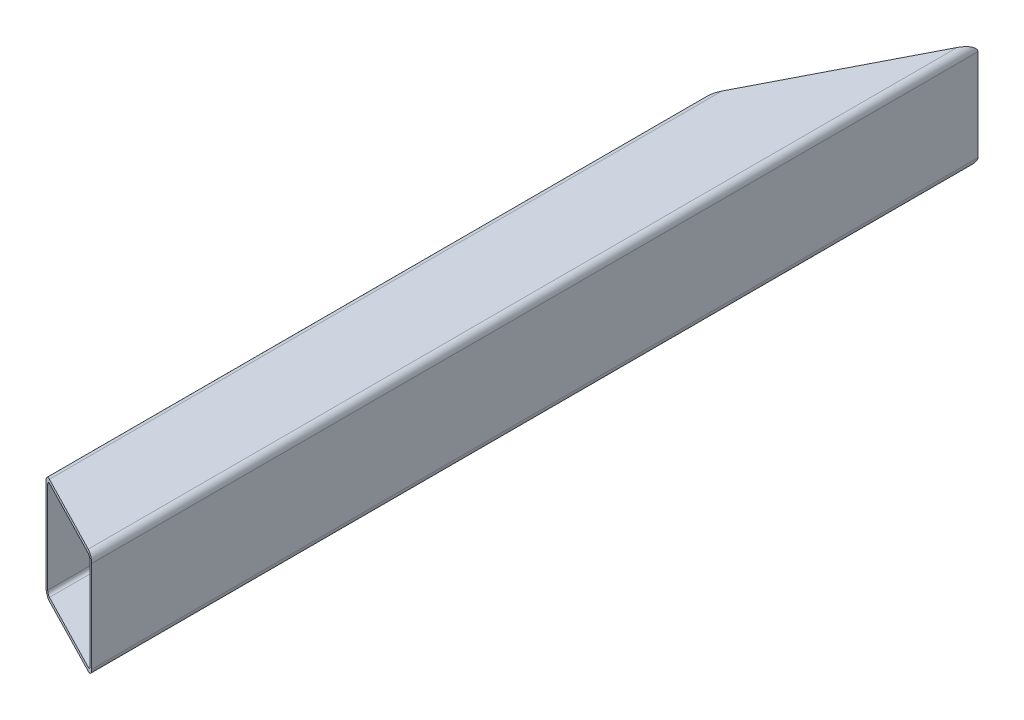
ISO-10303-21;
HEADER;
FILE_DESCRIPTION(('STEP AP214'),'2;1');
FILE_NAME('part.step','',(''),(''),'','','');
FILE_SCHEMA(('AUTOMOTIVE_DESIGN { 1 0 10303 214 1 1 1 1 }'));
ENDSEC;
DATA;
#1=APPLICATION_CONTEXT('core data for automotive mechanical design processes');
#2=APPLICATION_PROTOCOL_DEFINITION('international standard','automotive_design',2000,#1);
#3=PRODUCT_CONTEXT('',#1,'mechanical');
#4=PRODUCT('Part','Part','',(#3));
#5=PRODUCT_RELATED_PRODUCT_CATEGORY('part','',(#4));
#6=PRODUCT_DEFINITION_FORMATION('','',#4);
#7=PRODUCT_DEFINITION_CONTEXT('part definition',#1,'design');
#8=PRODUCT_DEFINITION('design','',#6,#7);
#9=PRODUCT_DEFINITION_SHAPE('','',#8);
#10=(LENGTH_UNIT() NAMED_UNIT(*) SI_UNIT(.MILLI.,.METRE.));
#11=(NAMED_UNIT(*) PLANE_ANGLE_UNIT() SI_UNIT($,.RADIAN.));
#12=(NAMED_UNIT(*) SI_UNIT($,.STERADIAN.) SOLID_ANGLE_UNIT());
#13=UNCERTAINTY_MEASURE_WITH_UNIT(LENGTH_MEASURE(1.E-05),#10,'distance_accuracy_value','');
#14=(GEOMETRIC_REPRESENTATION_CONTEXT(3) GLOBAL_UNCERTAINTY_ASSIGNED_CONTEXT((#13)) GLOBAL_UNIT_ASSIGNED_CONTEXT((#10,
#11,#12)) REPRESENTATION_CONTEXT('',''));
#15=CARTESIAN_POINT('',(0.,0.,0.));
#16=DIRECTION('',(0.,0.,1.));
#17=DIRECTION('',(1.,0.,0.));
#18=AXIS2_PLACEMENT_3D('',#15,#16,#17);
#19=CARTESIAN_POINT('',(-37.,38.9999999999999,754.));
#20=DIRECTION('',(1.,0.,0.));
#21=DIRECTION('',(0.,1.,0.));
#22=AXIS2_PLACEMENT_3D('',#19,#20,#21);
#23=PLANE('',#22);
#24=DIRECTION('',(0.,1.,0.));
#25=VECTOR('',#24,1.);
#26=CARTESIAN_POINT('',(-37.,38.9999999999999,714.399999995425));
#27=LINE('',#26,#25);
#28=CARTESIAN_POINT('',(-37.,-39.,714.399999995425));
#29=VERTEX_POINT('',#28);
#30=CARTESIAN_POINT('',(-37.,39.,714.399999995425));
#31=VERTEX_POINT('',#30);
#32=EDGE_CURVE('E12',#29,#31,#27,.T.);
#33=ORIENTED_EDGE('',*,*,#32,.F.);
#34=DIRECTION('',(0.,0.,-1.));
#35=VECTOR('',#34,1.);
#36=CARTESIAN_POINT('',(-37.,-39.,754.));
#37=LINE('',#36,#35);
#38=CARTESIAN_POINT('',(-37.,-39.,149.722222204925));
#39=VERTEX_POINT('',#38);
#40=EDGE_CURVE('E252',#29,#39,#37,.T.);
#41=ORIENTED_EDGE('',*,*,#40,.T.);
#42=DIRECTION('',(0.,-1.,0.));
#43=VECTOR('',#42,1.);
#44=CARTESIAN_POINT('',(-37.,39.0000000000003,149.722222204925));
#45=LINE('',#44,#43);
#46=CARTESIAN_POINT('',(-37.,39.,149.722222204925));
#47=VERTEX_POINT('',#46);
#48=EDGE_CURVE('E93',#47,#39,#45,.T.);
#49=ORIENTED_EDGE('',*,*,#48,.F.);
#50=DIRECTION('',(0.,0.,-1.));
#51=VECTOR('',#50,1.);
#52=CARTESIAN_POINT('',(-37.,39.,754.));
#53=LINE('',#52,#51);
#54=EDGE_CURVE('E258',#31,#47,#53,.T.);
#55=ORIENTED_EDGE('',*,*,#54,.F.);
#56=EDGE_LOOP('',(#33,#41,#49,#55));
#57=FACE_BOUND('',#56,.T.);
#58=ADVANCED_FACE('F85',(#57),#23,.T.);
#59=CARTESIAN_POINT('',(-34.,39.,754.));
#60=DIRECTION('',(0.,0.,-1.));
#61=DIRECTION('',(-1.,0.,0.));
#62=AXIS2_PLACEMENT_3D('',#59,#60,#61);
#63=CYLINDRICAL_SURFACE('',#62,3.);
#64=CARTESIAN_POINT('',(-34.,39.,715.94285713846));
#65=DIRECTION('',(0.45734801266255,0.,-0.889287802296656));
#66=DIRECTION('',(-0.889287802296656,0.,-0.45734801266255));
#67=AXIS2_PLACEMENT_3D('',#64,#65,#66);
#68=ELLIPSE('',#67,3.37348605507943,3.);
#69=CARTESIAN_POINT('',(-34.,42.,715.94285713846));
#70=VERTEX_POINT('',#69);
#71=EDGE_CURVE('E313',#31,#70,#68,.T.);
#72=ORIENTED_EDGE('',*,*,#71,.F.);
#73=ORIENTED_EDGE('',*,*,#54,.T.);
#74=CARTESIAN_POINT('',(-34.,39.,143.888888872265));
#75=DIRECTION('',(0.889287802296657,0.,0.457348012662547));
#76=DIRECTION('',(0.457348012662547,0.,-0.889287802296657));
#77=AXIS2_PLACEMENT_3D('',#74,#75,#76);
#78=ELLIPSE('',#77,6.55955621745216,3.);
#79=CARTESIAN_POINT('',(-34.,42.,143.888888872265));
#80=VERTEX_POINT('',#79);
#81=EDGE_CURVE('E242',#80,#47,#78,.T.);
#82=ORIENTED_EDGE('',*,*,#81,.F.);
#83=DIRECTION('',(0.,0.,-1.));
#84=VECTOR('',#83,1.);
#85=CARTESIAN_POINT('',(-34.,42.,754.));
#86=LINE('',#85,#84);
#87=EDGE_CURVE('E261',#70,#80,#86,.T.);
#88=ORIENTED_EDGE('',*,*,#87,.F.);
#89=EDGE_LOOP('',(#72,#73,#82,#88));
#90=FACE_BOUND('',#89,.T.);
#91=ADVANCED_FACE('F348',(#90),#63,.F.);
#92=CARTESIAN_POINT('',(34.,42.,754.));
#93=DIRECTION('',(0.,-1.,0.));
#94=DIRECTION('',(1.,0.,0.));
#95=AXIS2_PLACEMENT_3D('',#92,#93,#94);
#96=PLANE('',#95);
#97=DIRECTION('',(0.889287802296656,0.,0.45734801266255));
#98=VECTOR('',#97,1.);
#99=CARTESIAN_POINT('',(35.2550032281183,42.,751.559715945607));
#100=LINE('',#99,#98);
#101=CARTESIAN_POINT('',(34.,42.,750.914285713929));
#102=VERTEX_POINT('',#101);
#103=EDGE_CURVE('E316',#70,#102,#100,.T.);
#104=ORIENTED_EDGE('',*,*,#103,.F.);
#105=ORIENTED_EDGE('',*,*,#87,.T.);
#106=DIRECTION('',(-0.457348012662547,0.,0.889287802296657));
#107=VECTOR('',#106,1.);
#108=CARTESIAN_POINT('',(-267.917366063445,41.9999999999999,598.728211720861));
#109=LINE('',#108,#107);
#110=CARTESIAN_POINT('',(34.,42.,11.6666666653188));
#111=VERTEX_POINT('',#110);
#112=EDGE_CURVE('E508',#111,#80,#109,.T.);
#113=ORIENTED_EDGE('',*,*,#112,.F.);
#114=DIRECTION('',(0.,0.,-1.));
#115=VECTOR('',#114,1.);
#116=CARTESIAN_POINT('',(34.,42.,754.));
#117=LINE('',#116,#115);
#118=EDGE_CURVE('E270',#102,#111,#117,.T.);
#119=ORIENTED_EDGE('',*,*,#118,.F.);
#120=EDGE_LOOP('',(#104,#105,#113,#119));
#121=FACE_BOUND('',#120,.T.);
#122=ADVANCED_FACE('F353',(#121),#96,.T.);
#123=CARTESIAN_POINT('',(34.,39.,754.));
#124=DIRECTION('',(0.,0.,-1.));
#125=DIRECTION('',(-1.,0.,0.));
#126=AXIS2_PLACEMENT_3D('',#123,#124,#125);
#127=CYLINDRICAL_SURFACE('',#126,3.);
#128=CARTESIAN_POINT('',(34.,39.,750.914285713929));
#129=DIRECTION('',(0.45734801266255,0.,-0.889287802296656));
#130=DIRECTION('',(-0.889287802296656,0.,-0.45734801266255));
#131=AXIS2_PLACEMENT_3D('',#128,#129,#130);
#132=ELLIPSE('',#131,3.37348605507943,3.);
#133=CARTESIAN_POINT('',(37.,39.,752.457142856965));
#134=VERTEX_POINT('',#133);
#135=EDGE_CURVE('E323',#102,#134,#132,.T.);
#136=ORIENTED_EDGE('',*,*,#135,.F.);
#137=ORIENTED_EDGE('',*,*,#118,.T.);
#138=CARTESIAN_POINT('',(34.,39.,11.6666666653188));
#139=DIRECTION('',(0.889287802296657,0.,0.457348012662547));
#140=DIRECTION('',(0.457348012662547,0.,-0.889287802296657));
#141=AXIS2_PLACEMENT_3D('',#138,#139,#140);
#142=ELLIPSE('',#141,6.55955621745216,3.);
#143=CARTESIAN_POINT('',(37.,39.,5.83333333265934));
#144=VERTEX_POINT('',#143);
#145=EDGE_CURVE('E504',#144,#111,#142,.T.);
#146=ORIENTED_EDGE('',*,*,#145,.F.);
#147=DIRECTION('',(0.,0.,-1.));
#148=VECTOR('',#147,1.);
#149=CARTESIAN_POINT('',(37.,39.,754.));
#150=LINE('',#149,#148);
#151=EDGE_CURVE('E273',#134,#144,#150,.T.);
#152=ORIENTED_EDGE('',*,*,#151,.F.);
#153=EDGE_LOOP('',(#136,#137,#146,#152));
#154=FACE_BOUND('',#153,.T.);
#155=ADVANCED_FACE('F359',(#154),#127,.F.);
#156=CARTESIAN_POINT('',(37.,39.,754.));
#157=DIRECTION('',(-1.,0.,0.));
#158=DIRECTION('',(0.,-1.,0.));
#159=AXIS2_PLACEMENT_3D('',#156,#157,#158);
#160=PLANE('',#159);
#161=DIRECTION('',(0.,-1.,0.));
#162=VECTOR('',#161,1.);
#163=CARTESIAN_POINT('',(37.,39.,752.457142856965));
#164=LINE('',#163,#162);
#165=CARTESIAN_POINT('',(37.,-39.,752.457142856965));
#166=VERTEX_POINT('',#165);
#167=EDGE_CURVE('E325',#134,#166,#164,.T.);
#168=ORIENTED_EDGE('',*,*,#167,.F.);
#169=ORIENTED_EDGE('',*,*,#151,.T.);
#170=DIRECTION('',(0.,1.,0.));
#171=VECTOR('',#170,1.);
#172=CARTESIAN_POINT('',(37.,39.0000000000002,5.83333333265934));
#173=LINE('',#172,#171);
#174=CARTESIAN_POINT('',(37.,-39.,5.83333333265931));
#175=VERTEX_POINT('',#174);
#176=EDGE_CURVE('E501',#175,#144,#173,.T.);
#177=ORIENTED_EDGE('',*,*,#176,.F.);
#178=DIRECTION('',(0.,0.,-1.));
#179=VECTOR('',#178,1.);
#180=CARTESIAN_POINT('',(37.,-39.,754.));
#181=LINE('',#180,#179);
#182=EDGE_CURVE('E276',#166,#175,#181,.T.);
#183=ORIENTED_EDGE('',*,*,#182,.F.);
#184=EDGE_LOOP('',(#168,#169,#177,#183));
#185=FACE_BOUND('',#184,.T.);
#186=ADVANCED_FACE('F363',(#185),#160,.T.);
#187=CARTESIAN_POINT('',(34.,-39.,754.));
#188=DIRECTION('',(0.,0.,-1.));
#189=DIRECTION('',(-1.,0.,0.));
#190=AXIS2_PLACEMENT_3D('',#187,#188,#189);
#191=CYLINDRICAL_SURFACE('',#190,3.);
#192=CARTESIAN_POINT('',(34.,-39.,750.914285713929));
#193=DIRECTION('',(0.45734801266255,0.,-0.889287802296656));
#194=DIRECTION('',(-0.889287802296656,0.,-0.45734801266255));
#195=AXIS2_PLACEMENT_3D('',#192,#193,#194);
#196=ELLIPSE('',#195,3.37348605507943,3.);
#197=CARTESIAN_POINT('',(34.,-42.,750.914285713929));
#198=VERTEX_POINT('',#197);
#199=EDGE_CURVE('E327',#166,#198,#196,.T.);
#200=ORIENTED_EDGE('',*,*,#199,.F.);
#201=ORIENTED_EDGE('',*,*,#182,.T.);
#202=CARTESIAN_POINT('',(34.,-39.,11.6666666653188));
#203=DIRECTION('',(0.889287802296657,0.,0.457348012662547));
#204=DIRECTION('',(0.457348012662547,0.,-0.889287802296657));
#205=AXIS2_PLACEMENT_3D('',#202,#203,#204);
#206=ELLIPSE('',#205,6.55955621745216,3.);
#207=CARTESIAN_POINT('',(34.,-42.,11.6666666653189));
#208=VERTEX_POINT('',#207);
#209=EDGE_CURVE('E499',#208,#175,#206,.T.);
#210=ORIENTED_EDGE('',*,*,#209,.F.);
#211=DIRECTION('',(0.,0.,-1.));
#212=VECTOR('',#211,1.);
#213=CARTESIAN_POINT('',(34.,-42.,754.));
#214=LINE('',#213,#212);
#215=EDGE_CURVE('E279',#198,#208,#214,.T.);
#216=ORIENTED_EDGE('',*,*,#215,.F.);
#217=EDGE_LOOP('',(#200,#201,#210,#216));
#218=FACE_BOUND('',#217,.T.);
#219=ADVANCED_FACE('F367',(#218),#191,.F.);
#220=CARTESIAN_POINT('',(34.,-42.,754.));
#221=DIRECTION('',(0.,1.,0.));
#222=DIRECTION('',(0.,0.,1.));
#223=AXIS2_PLACEMENT_3D('',#220,#221,#222);
#224=PLANE('',#223);
#225=DIRECTION('',(-0.889287802296656,0.,-0.45734801266255));
#226=VECTOR('',#225,1.);
#227=CARTESIAN_POINT('',(35.2550032281183,-42.,751.559715945607));
#228=LINE('',#227,#226);
#229=CARTESIAN_POINT('',(-34.,-42.,715.94285713846));
#230=VERTEX_POINT('',#229);
#231=EDGE_CURVE('E329',#198,#230,#228,.T.);
#232=ORIENTED_EDGE('',*,*,#231,.F.);
#233=ORIENTED_EDGE('',*,*,#215,.T.);
#234=DIRECTION('',(0.457348012662547,0.,-0.889287802296657));
#235=VECTOR('',#234,1.);
#236=CARTESIAN_POINT('',(-267.917366063445,-42.,598.728211720861));
#237=LINE('',#236,#235);
#238=CARTESIAN_POINT('',(-34.,-42.,143.888888872265));
#239=VERTEX_POINT('',#238);
#240=EDGE_CURVE('E255',#239,#208,#237,.T.);
#241=ORIENTED_EDGE('',*,*,#240,.F.);
#242=DIRECTION('',(0.,0.,-1.));
#243=VECTOR('',#242,1.);
#244=CARTESIAN_POINT('',(-34.,-42.,754.));
#245=LINE('',#244,#243);
#246=EDGE_CURVE('E254',#230,#239,#245,.T.);
#247=ORIENTED_EDGE('',*,*,#246,.F.);
#248=EDGE_LOOP('',(#232,#233,#241,#247));
#249=FACE_BOUND('',#248,.T.);
#250=ADVANCED_FACE('F371',(#249),#224,.T.);
#251=CARTESIAN_POINT('',(-34.,-39.,754.));
#252=DIRECTION('',(0.,0.,-1.));
#253=DIRECTION('',(-1.,0.,0.));
#254=AXIS2_PLACEMENT_3D('',#251,#252,#253);
#255=CYLINDRICAL_SURFACE('',#254,3.);
#256=CARTESIAN_POINT('',(-34.,-39.,715.94285713846));
#257=DIRECTION('',(0.45734801266255,0.,-0.889287802296656));
#258=DIRECTION('',(-0.889287802296656,0.,-0.45734801266255));
#259=AXIS2_PLACEMENT_3D('',#256,#257,#258);
#260=ELLIPSE('',#259,3.37348605507943,3.);
#261=EDGE_CURVE('E331',#230,#29,#260,.T.);
#262=ORIENTED_EDGE('',*,*,#261,.F.);
#263=ORIENTED_EDGE('',*,*,#246,.T.);
#264=CARTESIAN_POINT('',(-34.,-39.,143.888888872265));
#265=DIRECTION('',(0.889287802296657,0.,0.457348012662547));
#266=DIRECTION('',(0.457348012662547,0.,-0.889287802296657));
#267=AXIS2_PLACEMENT_3D('',#264,#265,#266);
#268=ELLIPSE('',#267,6.55955621745216,3.);
#269=EDGE_CURVE('E213',#39,#239,#268,.T.);
#270=ORIENTED_EDGE('',*,*,#269,.F.);
#271=ORIENTED_EDGE('',*,*,#40,.F.);
#272=EDGE_LOOP('',(#262,#263,#270,#271));
#273=FACE_BOUND('',#272,.T.);
#274=ADVANCED_FACE('F251',(#273),#255,.F.);
#275=CARTESIAN_POINT('',(40.,-60.,0.));
#276=DIRECTION('',(0.889287802296657,0.,0.457348012662547));
#277=DIRECTION('',(0.457348012662547,0.,-0.889287802296657));
#278=AXIS2_PLACEMENT_3D('',#275,#276,#277);
#279=PLANE('',#278);
#280=ORIENTED_EDGE('',*,*,#269,.T.);
#281=ORIENTED_EDGE('',*,*,#240,.T.);
#282=ORIENTED_EDGE('',*,*,#209,.T.);
#283=ORIENTED_EDGE('',*,*,#176,.T.);
#284=ORIENTED_EDGE('',*,*,#145,.T.);
#285=ORIENTED_EDGE('',*,*,#112,.T.);
#286=ORIENTED_EDGE('',*,*,#81,.T.);
#287=ORIENTED_EDGE('',*,*,#48,.T.);
#288=EDGE_LOOP('',(#280,#281,#282,#283,#284,#285,#286,#287));
#289=FACE_BOUND('',#288,.T.);
#290=DIRECTION('',(0.,1.,0.));
#291=VECTOR('',#290,1.);
#292=CARTESIAN_POINT('',(-40.,-60.,155.555555537584));
#293=LINE('',#292,#291);
#294=CARTESIAN_POINT('',(-40.,-39.,155.555555537584));
#295=VERTEX_POINT('',#294);
#296=CARTESIAN_POINT('',(-40.,38.9999999999999,155.555555537584));
#297=VERTEX_POINT('',#296);
#298=EDGE_CURVE('E194',#295,#297,#293,.T.);
#299=ORIENTED_EDGE('',*,*,#298,.T.);
#300=CARTESIAN_POINT('',(-34.,39.,143.888888872265));
#301=DIRECTION('',(0.889287802296657,0.,0.457348012662547));
#302=DIRECTION('',(0.457348012662547,0.,-0.889287802296657));
#303=AXIS2_PLACEMENT_3D('',#300,#301,#302);
#304=ELLIPSE('',#303,13.1191124349043,6.);
#305=CARTESIAN_POINT('',(-34.,45.,143.888888872265));
#306=VERTEX_POINT('',#305);
#307=EDGE_CURVE('E197',#306,#297,#304,.T.);
#308=ORIENTED_EDGE('',*,*,#307,.F.);
#309=DIRECTION('',(-0.457348012662547,0.,0.889287802296657));
#310=VECTOR('',#309,1.);
#311=CARTESIAN_POINT('',(-267.917366063445,44.9999999999999,598.728211720861));
#312=LINE('',#311,#310);
#313=CARTESIAN_POINT('',(34.,45.,11.6666666653189));
#314=VERTEX_POINT('',#313);
#315=EDGE_CURVE('E212',#314,#306,#312,.T.);
#316=ORIENTED_EDGE('',*,*,#315,.F.);
#317=CARTESIAN_POINT('',(34.,39.,11.6666666653188));
#318=DIRECTION('',(0.889287802296657,0.,0.457348012662547));
#319=DIRECTION('',(0.457348012662547,0.,-0.889287802296657));
#320=AXIS2_PLACEMENT_3D('',#317,#318,#319);
#321=ELLIPSE('',#320,13.1191124349043,6.);
#322=CARTESIAN_POINT('',(40.,39.,0.));
#323=VERTEX_POINT('',#322);
#324=EDGE_CURVE('E296',#323,#314,#321,.T.);
#325=ORIENTED_EDGE('',*,*,#324,.F.);
#326=DIRECTION('',(0.,1.,0.));
#327=VECTOR('',#326,1.);
#328=CARTESIAN_POINT('',(40.,39.,0.));
#329=LINE('',#328,#327);
#330=CARTESIAN_POINT('',(40.,-39.,0.));
#331=VERTEX_POINT('',#330);
#332=EDGE_CURVE('E283',#331,#323,#329,.T.);
#333=ORIENTED_EDGE('',*,*,#332,.F.);
#334=CARTESIAN_POINT('',(34.,-39.,11.6666666653188));
#335=DIRECTION('',(0.889287802296657,0.,0.457348012662547));
#336=DIRECTION('',(0.457348012662547,0.,-0.889287802296657));
#337=AXIS2_PLACEMENT_3D('',#334,#335,#336);
#338=ELLIPSE('',#337,13.1191124349043,6.);
#339=CARTESIAN_POINT('',(34.,-45.,11.6666666653189));
#340=VERTEX_POINT('',#339);
#341=EDGE_CURVE('E318',#340,#331,#338,.T.);
#342=ORIENTED_EDGE('',*,*,#341,.F.);
#343=DIRECTION('',(0.457348012662547,0.,-0.889287802296657));
#344=VECTOR('',#343,1.);
#345=CARTESIAN_POINT('',(-267.917366063445,-45.,598.728211720861));
#346=LINE('',#345,#344);
#347=CARTESIAN_POINT('',(-34.,-45.,143.888888872265));
#348=VERTEX_POINT('',#347);
#349=EDGE_CURVE('E314',#348,#340,#346,.T.);
#350=ORIENTED_EDGE('',*,*,#349,.F.);
#351=CARTESIAN_POINT('',(-34.,-39.,143.888888872265));
#352=DIRECTION('',(0.889287802296657,0.,0.457348012662547));
#353=DIRECTION('',(0.457348012662547,0.,-0.889287802296657));
#354=AXIS2_PLACEMENT_3D('',#351,#352,#353);
#355=ELLIPSE('',#354,13.1191124349043,6.);
#356=EDGE_CURVE('E108',#295,#348,#355,.T.);
#357=ORIENTED_EDGE('',*,*,#356,.F.);
#358=EDGE_LOOP('',(#299,#308,#316,#325,#333,#342,#350,#357));
#359=FACE_BOUND('',#358,.T.);
#360=ADVANCED_FACE('F196',(#289,#359),#279,.F.);
#361=CARTESIAN_POINT('',(40.,-60.,754.));
#362=DIRECTION('',(0.45734801266255,0.,-0.889287802296656));
#363=DIRECTION('',(-0.889287802296656,0.,-0.45734801266255));
#364=AXIS2_PLACEMENT_3D('',#361,#362,#363);
#365=PLANE('',#364);
#366=ORIENTED_EDGE('',*,*,#261,.T.);
#367=ORIENTED_EDGE('',*,*,#32,.T.);
#368=ORIENTED_EDGE('',*,*,#71,.T.);
#369=ORIENTED_EDGE('',*,*,#103,.T.);
#370=ORIENTED_EDGE('',*,*,#135,.T.);
#371=ORIENTED_EDGE('',*,*,#167,.T.);
#372=ORIENTED_EDGE('',*,*,#199,.T.);
#373=ORIENTED_EDGE('',*,*,#231,.T.);
#374=EDGE_LOOP('',(#366,#367,#368,#369,#370,#371,#372,#373));
#375=FACE_BOUND('',#374,.T.);
#376=DIRECTION('',(-0.889287802296656,0.,-0.45734801266255));
#377=VECTOR('',#376,1.);
#378=CARTESIAN_POINT('',(35.2550032281183,-45.,751.559715945607));
#379=LINE('',#378,#377);
#380=CARTESIAN_POINT('',(34.,-45.,750.914285713929));
#381=VERTEX_POINT('',#380);
#382=CARTESIAN_POINT('',(-34.,-45.,715.94285713846));
#383=VERTEX_POINT('',#382);
#384=EDGE_CURVE('E264',#381,#383,#379,.T.);
#385=ORIENTED_EDGE('',*,*,#384,.F.);
#386=CARTESIAN_POINT('',(34.,-39.,750.914285713929));
#387=DIRECTION('',(0.45734801266255,0.,-0.889287802296656));
#388=DIRECTION('',(-0.889287802296656,0.,-0.45734801266255));
#389=AXIS2_PLACEMENT_3D('',#386,#387,#388);
#390=ELLIPSE('',#389,6.74697211015885,6.);
#391=CARTESIAN_POINT('',(40.,-39.,754.));
#392=VERTEX_POINT('',#391);
#393=EDGE_CURVE('E299',#392,#381,#390,.T.);
#394=ORIENTED_EDGE('',*,*,#393,.F.);
#395=DIRECTION('',(0.,1.,0.));
#396=VECTOR('',#395,1.);
#397=CARTESIAN_POINT('',(40.,39.,754.));
#398=LINE('',#397,#396);
#399=CARTESIAN_POINT('',(40.,39.,754.));
#400=VERTEX_POINT('',#399);
#401=EDGE_CURVE('E220',#392,#400,#398,.T.);
#402=ORIENTED_EDGE('',*,*,#401,.T.);
#403=CARTESIAN_POINT('',(34.,39.,750.914285713929));
#404=DIRECTION('',(0.45734801266255,0.,-0.889287802296656));
#405=DIRECTION('',(-0.889287802296656,0.,-0.45734801266255));
#406=AXIS2_PLACEMENT_3D('',#403,#404,#405);
#407=ELLIPSE('',#406,6.74697211015885,6.);
#408=CARTESIAN_POINT('',(34.,45.,750.914285713929));
#409=VERTEX_POINT('',#408);
#410=EDGE_CURVE('E297',#409,#400,#407,.T.);
#411=ORIENTED_EDGE('',*,*,#410,.F.);
#412=DIRECTION('',(0.889287802296656,0.,0.45734801266255));
#413=VECTOR('',#412,1.);
#414=CARTESIAN_POINT('',(35.2550032281183,45.,751.559715945607));
#415=LINE('',#414,#413);
#416=CARTESIAN_POINT('',(-34.,45.,715.94285713846));
#417=VERTEX_POINT('',#416);
#418=EDGE_CURVE('E300',#417,#409,#415,.T.);
#419=ORIENTED_EDGE('',*,*,#418,.F.);
#420=CARTESIAN_POINT('',(-34.,39.,715.94285713846));
#421=DIRECTION('',(0.45734801266255,0.,-0.889287802296656));
#422=DIRECTION('',(-0.889287802296656,0.,-0.45734801266255));
#423=AXIS2_PLACEMENT_3D('',#420,#421,#422);
#424=ELLIPSE('',#423,6.74697211015885,6.);
#425=CARTESIAN_POINT('',(-40.,38.9999999999999,712.857142852389));
#426=VERTEX_POINT('',#425);
#427=EDGE_CURVE('E100',#426,#417,#424,.T.);
#428=ORIENTED_EDGE('',*,*,#427,.F.);
#429=DIRECTION('',(0.,1.,0.));
#430=VECTOR('',#429,1.);
#431=CARTESIAN_POINT('',(-40.,-60.,712.857142852389));
#432=LINE('',#431,#430);
#433=CARTESIAN_POINT('',(-40.,-39.,712.857142852389));
#434=VERTEX_POINT('',#433);
#435=EDGE_CURVE('E203',#434,#426,#432,.T.);
#436=ORIENTED_EDGE('',*,*,#435,.F.);
#437=CARTESIAN_POINT('',(-34.,-39.,715.94285713846));
#438=DIRECTION('',(0.45734801266255,0.,-0.889287802296656));
#439=DIRECTION('',(-0.889287802296656,0.,-0.45734801266255));
#440=AXIS2_PLACEMENT_3D('',#437,#438,#439);
#441=ELLIPSE('',#440,6.74697211015885,6.);
#442=EDGE_CURVE('E259',#383,#434,#441,.T.);
#443=ORIENTED_EDGE('',*,*,#442,.F.);
#444=EDGE_LOOP('',(#385,#394,#402,#411,#419,#428,#436,#443));
#445=FACE_BOUND('',#444,.T.);
#446=ADVANCED_FACE('F338',(#375,#445),#365,.F.);
#447=CARTESIAN_POINT('',(-34.,-39.,754.));
#448=DIRECTION('',(0.,0.,-1.));
#449=DIRECTION('',(-1.,0.,0.));
#450=AXIS2_PLACEMENT_3D('',#447,#448,#449);
#451=CYLINDRICAL_SURFACE('',#450,6.);
#452=DIRECTION('',(0.,0.,-1.));
#453=VECTOR('',#452,1.);
#454=CARTESIAN_POINT('',(-34.,-45.,754.));
#455=LINE('',#454,#453);
#456=EDGE_CURVE('E235',#383,#348,#455,.T.);
#457=ORIENTED_EDGE('',*,*,#456,.F.);
#458=ORIENTED_EDGE('',*,*,#442,.T.);
#459=DIRECTION('',(0.,0.,-1.));
#460=VECTOR('',#459,1.);
#461=CARTESIAN_POINT('',(-40.,-39.,754.));
#462=LINE('',#461,#460);
#463=EDGE_CURVE('E216',#434,#295,#462,.T.);
#464=ORIENTED_EDGE('',*,*,#463,.T.);
#465=ORIENTED_EDGE('',*,*,#356,.T.);
#466=EDGE_LOOP('',(#457,#458,#464,#465));
#467=FACE_BOUND('',#466,.T.);
#468=ADVANCED_FACE('F87',(#467),#451,.T.);
#469=CARTESIAN_POINT('',(34.,-45.,754.));
#470=DIRECTION('',(0.,1.,0.));
#471=DIRECTION('',(0.,0.,1.));
#472=AXIS2_PLACEMENT_3D('',#469,#470,#471);
#473=PLANE('',#472);
#474=DIRECTION('',(0.,0.,-1.));
#475=VECTOR('',#474,1.);
#476=CARTESIAN_POINT('',(34.,-45.,754.));
#477=LINE('',#476,#475);
#478=EDGE_CURVE('E232',#381,#340,#477,.T.);
#479=ORIENTED_EDGE('',*,*,#478,.F.);
#480=ORIENTED_EDGE('',*,*,#384,.T.);
#481=ORIENTED_EDGE('',*,*,#456,.T.);
#482=ORIENTED_EDGE('',*,*,#349,.T.);
#483=EDGE_LOOP('',(#479,#480,#481,#482));
#484=FACE_BOUND('',#483,.T.);
#485=ADVANCED_FACE('F310',(#484),#473,.F.);
#486=CARTESIAN_POINT('',(34.,-39.,754.));
#487=DIRECTION('',(0.,0.,-1.));
#488=DIRECTION('',(-1.,0.,0.));
#489=AXIS2_PLACEMENT_3D('',#486,#487,#488);
#490=CYLINDRICAL_SURFACE('',#489,6.);
#491=DIRECTION('',(0.,0.,-1.));
#492=VECTOR('',#491,1.);
#493=CARTESIAN_POINT('',(40.,-39.,754.));
#494=LINE('',#493,#492);
#495=EDGE_CURVE('E229',#392,#331,#494,.T.);
#496=ORIENTED_EDGE('',*,*,#495,.F.);
#497=ORIENTED_EDGE('',*,*,#393,.T.);
#498=ORIENTED_EDGE('',*,*,#478,.T.);
#499=ORIENTED_EDGE('',*,*,#341,.T.);
#500=EDGE_LOOP('',(#496,#497,#498,#499));
#501=FACE_BOUND('',#500,.T.);
#502=ADVANCED_FACE('F337',(#501),#490,.T.);
#503=CARTESIAN_POINT('',(40.,39.,754.));
#504=DIRECTION('',(-1.,0.,0.));
#505=DIRECTION('',(0.,-1.,0.));
#506=AXIS2_PLACEMENT_3D('',#503,#504,#505);
#507=PLANE('',#506);
#508=ORIENTED_EDGE('',*,*,#332,.T.);
#509=DIRECTION('',(0.,0.,-1.));
#510=VECTOR('',#509,1.);
#511=CARTESIAN_POINT('',(40.,39.,754.));
#512=LINE('',#511,#510);
#513=EDGE_CURVE('E226',#400,#323,#512,.T.);
#514=ORIENTED_EDGE('',*,*,#513,.F.);
#515=ORIENTED_EDGE('',*,*,#401,.F.);
#516=ORIENTED_EDGE('',*,*,#495,.T.);
#517=EDGE_LOOP('',(#508,#514,#515,#516));
#518=FACE_BOUND('',#517,.T.);
#519=ADVANCED_FACE('F287',(#518),#507,.F.);
#520=CARTESIAN_POINT('',(34.,39.,754.));
#521=DIRECTION('',(0.,0.,-1.));
#522=DIRECTION('',(-1.,0.,0.));
#523=AXIS2_PLACEMENT_3D('',#520,#521,#522);
#524=CYLINDRICAL_SURFACE('',#523,6.);
#525=DIRECTION('',(0.,0.,-1.));
#526=VECTOR('',#525,1.);
#527=CARTESIAN_POINT('',(34.,45.,754.));
#528=LINE('',#527,#526);
#529=EDGE_CURVE('E218',#409,#314,#528,.T.);
#530=ORIENTED_EDGE('',*,*,#529,.F.);
#531=ORIENTED_EDGE('',*,*,#410,.T.);
#532=ORIENTED_EDGE('',*,*,#513,.T.);
#533=ORIENTED_EDGE('',*,*,#324,.T.);
#534=EDGE_LOOP('',(#530,#531,#532,#533));
#535=FACE_BOUND('',#534,.T.);
#536=ADVANCED_FACE('F295',(#535),#524,.T.);
#537=CARTESIAN_POINT('',(34.,45.,754.));
#538=DIRECTION('',(0.,-1.,0.));
#539=DIRECTION('',(1.,0.,0.));
#540=AXIS2_PLACEMENT_3D('',#537,#538,#539);
#541=PLANE('',#540);
#542=DIRECTION('',(0.,0.,-1.));
#543=VECTOR('',#542,1.);
#544=CARTESIAN_POINT('',(-34.,45.,754.));
#545=LINE('',#544,#543);
#546=EDGE_CURVE('E211',#417,#306,#545,.T.);
#547=ORIENTED_EDGE('',*,*,#546,.F.);
#548=ORIENTED_EDGE('',*,*,#418,.T.);
#549=ORIENTED_EDGE('',*,*,#529,.T.);
#550=ORIENTED_EDGE('',*,*,#315,.T.);
#551=EDGE_LOOP('',(#547,#548,#549,#550));
#552=FACE_BOUND('',#551,.T.);
#553=ADVANCED_FACE('F333',(#552),#541,.F.);
#554=CARTESIAN_POINT('',(-34.,39.,754.));
#555=DIRECTION('',(0.,0.,-1.));
#556=DIRECTION('',(-1.,0.,0.));
#557=AXIS2_PLACEMENT_3D('',#554,#555,#556);
#558=CYLINDRICAL_SURFACE('',#557,6.);
#559=DIRECTION('',(0.,0.,-1.));
#560=VECTOR('',#559,1.);
#561=CARTESIAN_POINT('',(-40.,38.9999999999999,754.));
#562=LINE('',#561,#560);
#563=EDGE_CURVE('E209',#426,#297,#562,.T.);
#564=ORIENTED_EDGE('',*,*,#563,.F.);
#565=ORIENTED_EDGE('',*,*,#427,.T.);
#566=ORIENTED_EDGE('',*,*,#546,.T.);
#567=ORIENTED_EDGE('',*,*,#307,.T.);
#568=EDGE_LOOP('',(#564,#565,#566,#567));
#569=FACE_BOUND('',#568,.T.);
#570=ADVANCED_FACE('F208',(#569),#558,.T.);
#571=CARTESIAN_POINT('',(-40.,38.9999999999999,754.));
#572=DIRECTION('',(1.,0.,0.));
#573=DIRECTION('',(0.,1.,0.));
#574=AXIS2_PLACEMENT_3D('',#571,#572,#573);
#575=PLANE('',#574);
#576=ORIENTED_EDGE('',*,*,#463,.F.);
#577=ORIENTED_EDGE('',*,*,#435,.T.);
#578=ORIENTED_EDGE('',*,*,#563,.T.);
#579=ORIENTED_EDGE('',*,*,#298,.F.);
#580=EDGE_LOOP('',(#576,#577,#578,#579));
#581=FACE_BOUND('',#580,.T.);
#582=ADVANCED_FACE('F215',(#581),#575,.F.);
#583=CLOSED_SHELL('',(#58,#91,#122,#155,#186,#219,#250,#274,#360,#446,#468,#485,#502,#519,#536,
#553,#570,#582));
#584=MANIFOLD_SOLID_BREP('B2',#583);
#585=ADVANCED_BREP_SHAPE_REPRESENTATION('',(#18,#584),#14);
#586=SHAPE_DEFINITION_REPRESENTATION(#9,#585);
ENDSEC;
END-ISO-10303-21;
